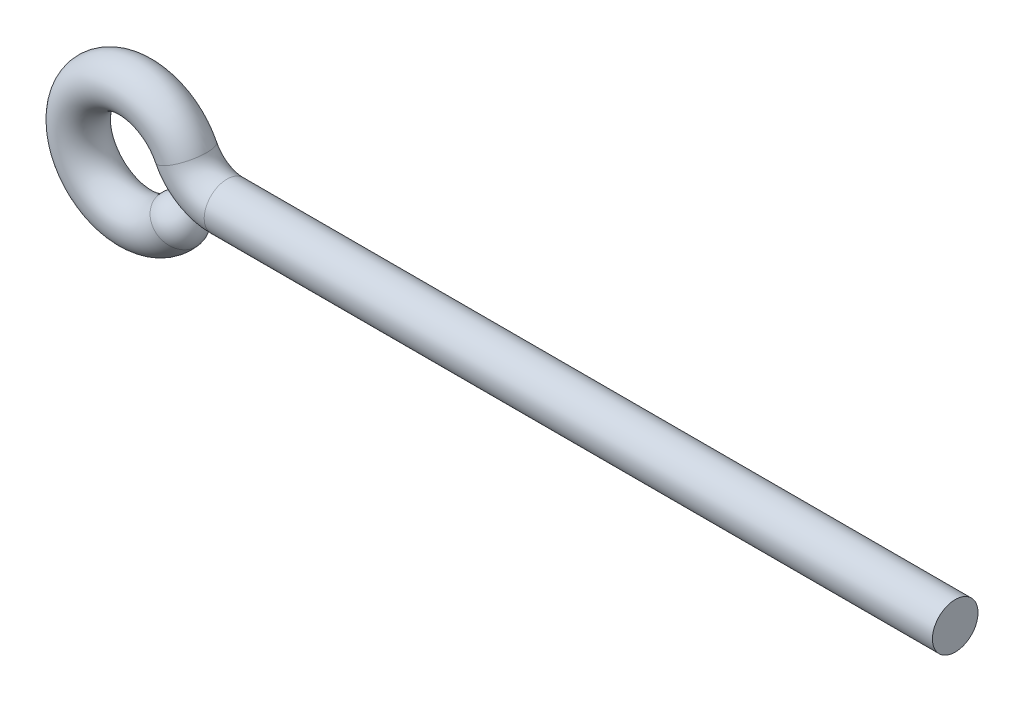
ISO-10303-21;
HEADER;
FILE_DESCRIPTION(('STEP AP214'),'2;1');
FILE_NAME('part.step','',(''),(''),'','','');
FILE_SCHEMA(('AUTOMOTIVE_DESIGN { 1 0 10303 214 1 1 1 1 }'));
ENDSEC;
DATA;
#1=APPLICATION_CONTEXT('core data for automotive mechanical design processes');
#2=APPLICATION_PROTOCOL_DEFINITION('international standard','automotive_design',2000,#1);
#3=PRODUCT_CONTEXT('',#1,'mechanical');
#4=PRODUCT('Part','Part','',(#3));
#5=PRODUCT_RELATED_PRODUCT_CATEGORY('part','',(#4));
#6=PRODUCT_DEFINITION_FORMATION('','',#4);
#7=PRODUCT_DEFINITION_CONTEXT('part definition',#1,'design');
#8=PRODUCT_DEFINITION('design','',#6,#7);
#9=PRODUCT_DEFINITION_SHAPE('','',#8);
#10=(LENGTH_UNIT() NAMED_UNIT(*) SI_UNIT(.MILLI.,.METRE.));
#11=(NAMED_UNIT(*) PLANE_ANGLE_UNIT() SI_UNIT($,.RADIAN.));
#12=(NAMED_UNIT(*) SI_UNIT($,.STERADIAN.) SOLID_ANGLE_UNIT());
#13=UNCERTAINTY_MEASURE_WITH_UNIT(LENGTH_MEASURE(1.E-05),#10,'distance_accuracy_value','');
#14=(GEOMETRIC_REPRESENTATION_CONTEXT(3) GLOBAL_UNCERTAINTY_ASSIGNED_CONTEXT((#13)) GLOBAL_UNIT_ASSIGNED_CONTEXT((#10,
#11,#12)) REPRESENTATION_CONTEXT('',''));
#15=CARTESIAN_POINT('',(0.,0.,0.));
#16=DIRECTION('',(0.,0.,1.));
#17=DIRECTION('',(1.,0.,0.));
#18=AXIS2_PLACEMENT_3D('',#15,#16,#17);
#19=CARTESIAN_POINT('',(-20.4244444610127,-8.03484512108169,0.));
#20=DIRECTION('',(0.,0.,1.));
#21=DIRECTION('',(1.,0.,0.));
#22=AXIS2_PLACEMENT_3D('',#19,#20,#21);
#23=SPHERICAL_SURFACE('',#22,5.);
#24=CARTESIAN_POINT('',(-20.4244444610127,-8.03484512108169,0.));
#25=DIRECTION('',(-0.642787609686535,-0.766044443118982,0.));
#26=DIRECTION('',(0.,0.,-1.));
#27=AXIS2_PLACEMENT_3D('',#24,#25,#26);
#28=SPHERICAL_SURFACE('',#27,5.);
#29=CARTESIAN_POINT('',(-20.4244444610127,-8.03484512108169,0.));
#30=DIRECTION('',(-0.642787609686535,-0.766044443118982,0.));
#31=DIRECTION('',(0.,0.,-1.));
#32=AXIS2_PLACEMENT_3D('',#29,#30,#31);
#33=CIRCLE('',#32,5.);
#34=CARTESIAN_POINT('',(-20.4244444610127,-8.03484512108169,-5.));
#35=VERTEX_POINT('',#34);
#36=EDGE_CURVE('E11',#35,#35,#33,.T.);
#37=ORIENTED_EDGE('',*,*,#36,.F.);
#38=EDGE_LOOP('',(#37));
#39=FACE_BOUND('',#38,.T.);
#40=ADVANCED_FACE('F33',(#39),#28,.T.);
#41=CARTESIAN_POINT('',(0.,0.,0.));
#42=DIRECTION('',(-1.,0.,0.));
#43=DIRECTION('',(0.,-1.,0.));
#44=AXIS2_PLACEMENT_3D('',#41,#42,#43);
#45=CYLINDRICAL_SURFACE('',#44,5.);
#46=CARTESIAN_POINT('',(-9.84435562925363,0.,0.));
#47=DIRECTION('',(1.,0.,0.));
#48=DIRECTION('',(0.,0.,-1.));
#49=AXIS2_PLACEMENT_3D('',#46,#47,#48);
#50=CIRCLE('',#49,5.);
#51=CARTESIAN_POINT('',(-9.84435562925363,-5.,0.));
#52=VERTEX_POINT('',#51);
#53=EDGE_CURVE('E70',#52,#52,#50,.T.);
#54=ORIENTED_EDGE('',*,*,#53,.T.);
#55=EDGE_LOOP('',(#54));
#56=FACE_BOUND('',#55,.T.);
#57=CARTESIAN_POINT('',(150.,0.,0.));
#58=DIRECTION('',(1.,0.,0.));
#59=DIRECTION('',(0.,0.,-1.));
#60=AXIS2_PLACEMENT_3D('',#57,#58,#59);
#61=CIRCLE('',#60,5.);
#62=CARTESIAN_POINT('',(150.,0.,-5.));
#63=VERTEX_POINT('',#62);
#64=EDGE_CURVE('E71',#63,#63,#61,.T.);
#65=ORIENTED_EDGE('',*,*,#64,.F.);
#66=EDGE_LOOP('',(#65));
#67=FACE_BOUND('',#66,.T.);
#68=ADVANCED_FACE('F46',(#56,#67),#45,.T.);
#69=CARTESIAN_POINT('',(-9.84435562925363,10.,0.));
#70=DIRECTION('',(0.,0.,-1.));
#71=DIRECTION('',(-1.,0.,0.));
#72=AXIS2_PLACEMENT_3D('',#69,#70,#71);
#73=TOROIDAL_SURFACE('',#72,10.,5.);
#74=CARTESIAN_POINT('',(-18.8024197940298,5.55555555555555,0.));
#75=DIRECTION('',(0.444444444444444,-0.895806416477617,0.));
#76=DIRECTION('',(0.,0.,-1.));
#77=AXIS2_PLACEMENT_3D('',#74,#75,#76);
#78=CIRCLE('',#77,5.);
#79=CARTESIAN_POINT('',(-23.2814518764179,3.33333333333333,0.));
#80=VERTEX_POINT('',#79);
#81=EDGE_CURVE('E39',#80,#80,#78,.T.);
#82=CARTESIAN_POINT('',(-9.84435562925363,10.,0.));
#83=DIRECTION('',(0.,0.,-1.));
#84=DIRECTION('',(-1.,0.,0.));
#85=AXIS2_PLACEMENT_3D('',#82,#83,#84);
#86=CIRCLE('',#85,15.);
#87=EDGE_CURVE('',#52,#80,#86,.T.);
#88=ORIENTED_EDGE('',*,*,#53,.F.);
#89=ORIENTED_EDGE('',*,*,#81,.T.);
#90=ORIENTED_EDGE('',*,*,#87,.T.);
#91=ORIENTED_EDGE('',*,*,#87,.F.);
#92=EDGE_LOOP('',(#88,#90,#89,#91));
#93=FACE_BOUND('',#92,.T.);
#94=ADVANCED_FACE('F51',(#93),#73,.T.);
#95=CARTESIAN_POINT('',(-30.,0.,0.));
#96=DIRECTION('',(0.,0.,1.));
#97=DIRECTION('',(1.,0.,0.));
#98=AXIS2_PLACEMENT_3D('',#95,#96,#97);
#99=TOROIDAL_SURFACE('',#98,12.5,5.);
#100=ORIENTED_EDGE('',*,*,#36,.T.);
#101=EDGE_LOOP('',(#100));
#102=FACE_BOUND('',#101,.T.);
#103=ORIENTED_EDGE('',*,*,#81,.F.);
#104=EDGE_LOOP('',(#103));
#105=FACE_BOUND('',#104,.T.);
#106=ADVANCED_FACE('F42',(#102,#105),#99,.T.);
#107=CARTESIAN_POINT('',(150.,0.,0.));
#108=DIRECTION('',(1.,0.,0.));
#109=DIRECTION('',(0.,0.,-1.));
#110=AXIS2_PLACEMENT_3D('',#107,#108,#109);
#111=PLANE('',#110);
#112=ORIENTED_EDGE('',*,*,#64,.T.);
#113=EDGE_LOOP('',(#112));
#114=FACE_BOUND('',#113,.T.);
#115=ADVANCED_FACE('F47',(#114),#111,.T.);
#116=CLOSED_SHELL('',(#40,#68,#94,#106,#115));
#117=MANIFOLD_SOLID_BREP('B2',#116);
#118=ADVANCED_BREP_SHAPE_REPRESENTATION('',(#18,#117),#14);
#119=SHAPE_DEFINITION_REPRESENTATION(#9,#118);
ENDSEC;
END-ISO-10303-21;
